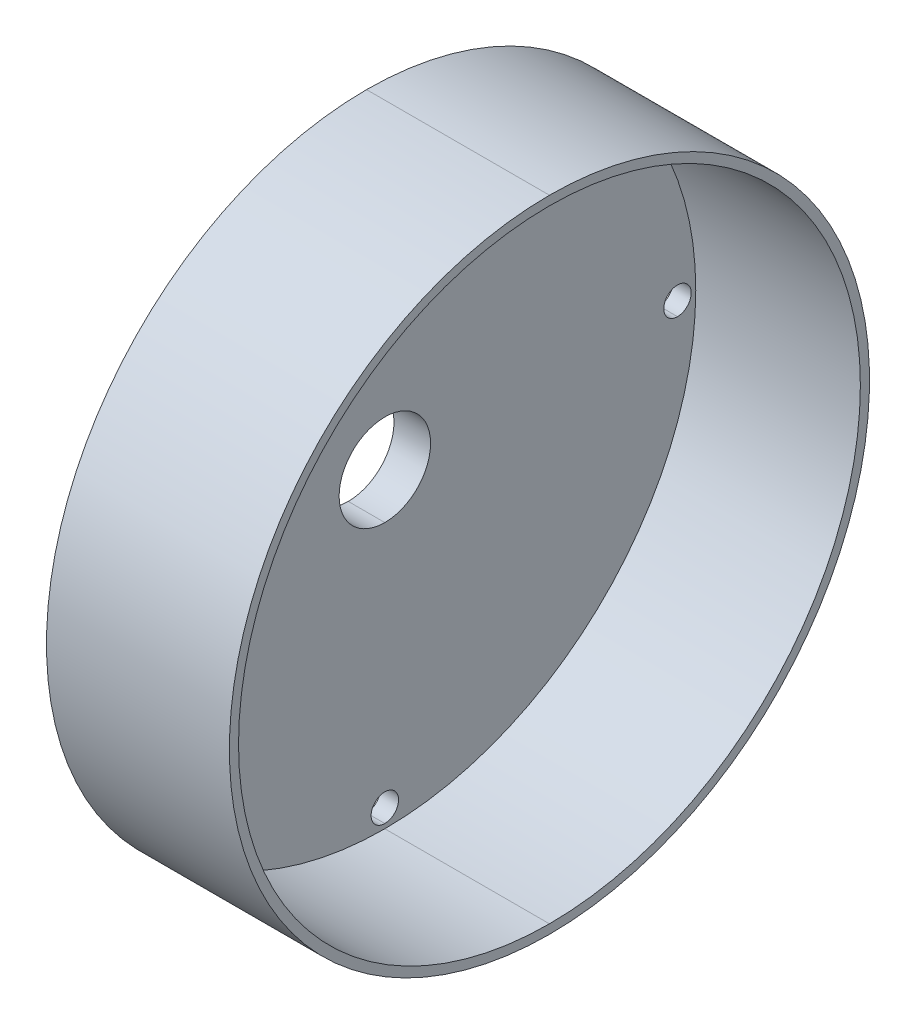
ISO-10303-21;
HEADER;
FILE_DESCRIPTION(('STEP AP214'),'2;1');
FILE_NAME('part.step','',(''),(''),'','','');
FILE_SCHEMA(('AUTOMOTIVE_DESIGN { 1 0 10303 214 1 1 1 1 }'));
ENDSEC;
DATA;
#1=APPLICATION_CONTEXT('core data for automotive mechanical design processes');
#2=APPLICATION_PROTOCOL_DEFINITION('international standard','automotive_design',2000,#1);
#3=PRODUCT_CONTEXT('',#1,'mechanical');
#4=PRODUCT('Part','Part','',(#3));
#5=PRODUCT_RELATED_PRODUCT_CATEGORY('part','',(#4));
#6=PRODUCT_DEFINITION_FORMATION('','',#4);
#7=PRODUCT_DEFINITION_CONTEXT('part definition',#1,'design');
#8=PRODUCT_DEFINITION('design','',#6,#7);
#9=PRODUCT_DEFINITION_SHAPE('','',#8);
#10=(LENGTH_UNIT() NAMED_UNIT(*) SI_UNIT(.MILLI.,.METRE.));
#11=(NAMED_UNIT(*) PLANE_ANGLE_UNIT() SI_UNIT($,.RADIAN.));
#12=(NAMED_UNIT(*) SI_UNIT($,.STERADIAN.) SOLID_ANGLE_UNIT());
#13=UNCERTAINTY_MEASURE_WITH_UNIT(LENGTH_MEASURE(1.E-05),#10,'distance_accuracy_value','');
#14=(GEOMETRIC_REPRESENTATION_CONTEXT(3) GLOBAL_UNCERTAINTY_ASSIGNED_CONTEXT((#13)) GLOBAL_UNIT_ASSIGNED_CONTEXT((#10,
#11,#12)) REPRESENTATION_CONTEXT('',''));
#15=CARTESIAN_POINT('',(0.,0.,0.));
#16=DIRECTION('',(0.,0.,1.));
#17=DIRECTION('',(1.,0.,0.));
#18=AXIS2_PLACEMENT_3D('',#15,#16,#17);
#19=CARTESIAN_POINT('',(6.90730482377682,0.,0.));
#20=DIRECTION('',(1.,0.,0.));
#21=DIRECTION('',(0.,-1.,0.));
#22=AXIS2_PLACEMENT_3D('',#19,#20,#21);
#23=CYLINDRICAL_SURFACE('',#22,5.76923076849808);
#24=DIRECTION('',(-1.,0.,0.));
#25=VECTOR('',#24,1.);
#26=CARTESIAN_POINT('',(6.90730482377682,-5.76923076849807,0.));
#27=LINE('',#26,#25);
#28=CARTESIAN_POINT('',(7.67653559290989,-5.76923076849807,0.));
#29=VERTEX_POINT('',#28);
#30=CARTESIAN_POINT('',(6.13807405464374,-5.76923076849807,0.));
#31=VERTEX_POINT('',#30);
#32=EDGE_CURVE('E72',#29,#31,#27,.T.);
#33=ORIENTED_EDGE('',*,*,#32,.F.);
#34=CARTESIAN_POINT('',(7.67653559290989,0.,0.));
#35=DIRECTION('',(-1.,0.,0.));
#36=DIRECTION('',(0.,-1.,0.));
#37=AXIS2_PLACEMENT_3D('',#34,#35,#36);
#38=CIRCLE('',#37,5.76923076849808);
#39=CARTESIAN_POINT('',(7.67653559290989,5.76923076849808,0.));
#40=VERTEX_POINT('',#39);
#41=EDGE_CURVE('E11',#29,#40,#38,.T.);
#42=ORIENTED_EDGE('',*,*,#41,.T.);
#43=DIRECTION('',(-1.,0.,0.));
#44=VECTOR('',#43,1.);
#45=CARTESIAN_POINT('',(6.90730482377682,5.76923076849808,0.));
#46=LINE('',#45,#44);
#47=CARTESIAN_POINT('',(6.13807405464374,5.76923076849808,0.));
#48=VERTEX_POINT('',#47);
#49=EDGE_CURVE('E59',#40,#48,#46,.T.);
#50=ORIENTED_EDGE('',*,*,#49,.T.);
#51=CARTESIAN_POINT('',(6.13807405464374,0.,0.));
#52=DIRECTION('',(-1.,0.,0.));
#53=DIRECTION('',(0.,-1.,0.));
#54=AXIS2_PLACEMENT_3D('',#51,#52,#53);
#55=CIRCLE('',#54,5.76923076849808);
#56=EDGE_CURVE('E294',#31,#48,#55,.T.);
#57=ORIENTED_EDGE('',*,*,#56,.F.);
#58=EDGE_LOOP('',(#33,#42,#50,#57));
#59=FACE_BOUND('',#58,.T.);
#60=ADVANCED_FACE('F48',(#59),#23,.T.);
#61=CARTESIAN_POINT('',(6.90730482377682,0.,0.));
#62=DIRECTION('',(1.,0.,0.));
#63=DIRECTION('',(0.,-1.,0.));
#64=AXIS2_PLACEMENT_3D('',#61,#62,#63);
#65=CYLINDRICAL_SURFACE('',#64,5.76923076849808);
#66=ORIENTED_EDGE('',*,*,#49,.F.);
#67=CARTESIAN_POINT('',(7.67653559290989,0.,0.));
#68=DIRECTION('',(-1.,0.,0.));
#69=DIRECTION('',(0.,-1.,0.));
#70=AXIS2_PLACEMENT_3D('',#67,#68,#69);
#71=CIRCLE('',#70,5.76923076849808);
#72=EDGE_CURVE('E280',#40,#29,#71,.T.);
#73=ORIENTED_EDGE('',*,*,#72,.T.);
#74=ORIENTED_EDGE('',*,*,#32,.T.);
#75=CARTESIAN_POINT('',(6.13807405464374,0.,0.));
#76=DIRECTION('',(-1.,0.,0.));
#77=DIRECTION('',(0.,-1.,0.));
#78=AXIS2_PLACEMENT_3D('',#75,#76,#77);
#79=CIRCLE('',#78,5.76923076849808);
#80=EDGE_CURVE('E288',#48,#31,#79,.T.);
#81=ORIENTED_EDGE('',*,*,#80,.F.);
#82=EDGE_LOOP('',(#66,#73,#74,#81));
#83=FACE_BOUND('',#82,.T.);
#84=ADVANCED_FACE('F379',(#83),#65,.T.);
#85=CARTESIAN_POINT('',(6.13807405464374,0.,0.));
#86=DIRECTION('',(-1.,0.,0.));
#87=DIRECTION('',(0.,-1.,0.));
#88=AXIS2_PLACEMENT_3D('',#85,#86,#87);
#89=PLANE('',#88);
#90=ORIENTED_EDGE('',*,*,#56,.T.);
#91=ORIENTED_EDGE('',*,*,#80,.T.);
#92=EDGE_LOOP('',(#90,#91));
#93=FACE_BOUND('',#92,.T.);
#94=CARTESIAN_POINT('',(6.13807405464374,0.,0.));
#95=DIRECTION('',(-1.,0.,0.));
#96=DIRECTION('',(0.,-1.,0.));
#97=AXIS2_PLACEMENT_3D('',#94,#95,#96);
#98=CIRCLE('',#97,3.84615384566538);
#99=CARTESIAN_POINT('',(6.13807405464374,3.84615384566539,0.));
#100=VERTEX_POINT('',#99);
#101=CARTESIAN_POINT('',(6.13807405464374,-3.84615384566538,0.));
#102=VERTEX_POINT('',#101);
#103=EDGE_CURVE('E215',#100,#102,#98,.T.);
#104=ORIENTED_EDGE('',*,*,#103,.F.);
#105=CARTESIAN_POINT('',(6.13807405464374,0.,0.));
#106=DIRECTION('',(-1.,0.,0.));
#107=DIRECTION('',(0.,-1.,0.));
#108=AXIS2_PLACEMENT_3D('',#105,#106,#107);
#109=CIRCLE('',#108,3.84615384566538);
#110=EDGE_CURVE('E216',#102,#100,#109,.T.);
#111=ORIENTED_EDGE('',*,*,#110,.F.);
#112=EDGE_LOOP('',(#104,#111));
#113=FACE_BOUND('',#112,.T.);
#114=ADVANCED_FACE('F374',(#93,#113),#89,.T.);
#115=CARTESIAN_POINT('',(15.3688432842407,0.,0.));
#116=DIRECTION('',(-1.,0.,0.));
#117=DIRECTION('',(0.,1.,0.));
#118=AXIS2_PLACEMENT_3D('',#115,#116,#117);
#119=CYLINDRICAL_SURFACE('',#118,26.9230769196577);
#120=DIRECTION('',(1.,0.,0.));
#121=VECTOR('',#120,1.);
#122=CARTESIAN_POINT('',(15.3688432842407,26.9230769196577,0.));
#123=LINE('',#122,#121);
#124=CARTESIAN_POINT('',(7.67653559290989,26.9230769196577,0.));
#125=VERTEX_POINT('',#124);
#126=CARTESIAN_POINT('',(23.0611509755714,26.9230769196577,0.));
#127=VERTEX_POINT('',#126);
#128=EDGE_CURVE('E175',#125,#127,#123,.T.);
#129=ORIENTED_EDGE('',*,*,#128,.F.);
#130=CARTESIAN_POINT('',(7.67653559290989,0.,0.));
#131=DIRECTION('',(1.,0.,0.));
#132=DIRECTION('',(0.,1.,0.));
#133=AXIS2_PLACEMENT_3D('',#130,#131,#132);
#134=CIRCLE('',#133,26.9230769196577);
#135=CARTESIAN_POINT('',(7.67653559290989,-26.9230769196577,0.));
#136=VERTEX_POINT('',#135);
#137=EDGE_CURVE('E285',#125,#136,#134,.T.);
#138=ORIENTED_EDGE('',*,*,#137,.T.);
#139=DIRECTION('',(1.,0.,0.));
#140=VECTOR('',#139,1.);
#141=CARTESIAN_POINT('',(15.3688432842407,-26.9230769196577,0.));
#142=LINE('',#141,#140);
#143=CARTESIAN_POINT('',(23.0611509755714,-26.9230769196577,0.));
#144=VERTEX_POINT('',#143);
#145=EDGE_CURVE('E178',#136,#144,#142,.T.);
#146=ORIENTED_EDGE('',*,*,#145,.T.);
#147=CARTESIAN_POINT('',(23.0611509755714,0.,0.));
#148=DIRECTION('',(1.,0.,0.));
#149=DIRECTION('',(0.,1.,0.));
#150=AXIS2_PLACEMENT_3D('',#147,#148,#149);
#151=CIRCLE('',#150,26.9230769196577);
#152=EDGE_CURVE('E170',#127,#144,#151,.T.);
#153=ORIENTED_EDGE('',*,*,#152,.F.);
#154=EDGE_LOOP('',(#129,#138,#146,#153));
#155=FACE_BOUND('',#154,.T.);
#156=ADVANCED_FACE('F173',(#155),#119,.T.);
#157=CARTESIAN_POINT('',(15.3688432842407,0.,0.));
#158=DIRECTION('',(-1.,0.,0.));
#159=DIRECTION('',(0.,1.,0.));
#160=AXIS2_PLACEMENT_3D('',#157,#158,#159);
#161=CYLINDRICAL_SURFACE('',#160,26.9230769196577);
#162=ORIENTED_EDGE('',*,*,#145,.F.);
#163=CARTESIAN_POINT('',(7.67653559290989,0.,0.));
#164=DIRECTION('',(1.,0.,0.));
#165=DIRECTION('',(0.,1.,0.));
#166=AXIS2_PLACEMENT_3D('',#163,#164,#165);
#167=CIRCLE('',#166,26.9230769196577);
#168=EDGE_CURVE('E191',#136,#125,#167,.T.);
#169=ORIENTED_EDGE('',*,*,#168,.T.);
#170=ORIENTED_EDGE('',*,*,#128,.T.);
#171=CARTESIAN_POINT('',(23.0611509755714,0.,0.));
#172=DIRECTION('',(1.,0.,0.));
#173=DIRECTION('',(0.,1.,0.));
#174=AXIS2_PLACEMENT_3D('',#171,#172,#173);
#175=CIRCLE('',#174,26.9230769196577);
#176=EDGE_CURVE('E184',#144,#127,#175,.T.);
#177=ORIENTED_EDGE('',*,*,#176,.F.);
#178=EDGE_LOOP('',(#162,#169,#170,#177));
#179=FACE_BOUND('',#178,.T.);
#180=ADVANCED_FACE('F189',(#179),#161,.T.);
#181=CARTESIAN_POINT('',(7.67653559290989,0.,0.));
#182=DIRECTION('',(1.,0.,0.));
#183=DIRECTION('',(0.,1.,0.));
#184=AXIS2_PLACEMENT_3D('',#181,#182,#183);
#185=PLANE('',#184);
#186=ORIENTED_EDGE('',*,*,#168,.F.);
#187=ORIENTED_EDGE('',*,*,#137,.F.);
#188=EDGE_LOOP('',(#186,#187));
#189=FACE_BOUND('',#188,.T.);
#190=ORIENTED_EDGE('',*,*,#72,.F.);
#191=ORIENTED_EDGE('',*,*,#41,.F.);
#192=EDGE_LOOP('',(#190,#191));
#193=FACE_BOUND('',#192,.T.);
#194=CARTESIAN_POINT('',(7.67653559290989,0.,24.6153846122585));
#195=DIRECTION('',(1.,0.,0.));
#196=DIRECTION('',(0.,1.,0.));
#197=AXIS2_PLACEMENT_3D('',#194,#195,#196);
#198=CIRCLE('',#197,1.15384615369962);
#199=CARTESIAN_POINT('',(7.67653559290989,-1.15384615369961,24.6153846122585));
#200=VERTEX_POINT('',#199);
#201=CARTESIAN_POINT('',(7.67653559290989,1.15384615369962,24.6153846122585));
#202=VERTEX_POINT('',#201);
#203=EDGE_CURVE('E193',#200,#202,#198,.T.);
#204=ORIENTED_EDGE('',*,*,#203,.T.);
#205=CARTESIAN_POINT('',(7.67653559290989,0.,24.6153846122585));
#206=DIRECTION('',(1.,0.,0.));
#207=DIRECTION('',(0.,1.,0.));
#208=AXIS2_PLACEMENT_3D('',#205,#206,#207);
#209=CIRCLE('',#208,1.15384615369962);
#210=EDGE_CURVE('E223',#202,#200,#209,.T.);
#211=ORIENTED_EDGE('',*,*,#210,.T.);
#212=EDGE_LOOP('',(#204,#211));
#213=FACE_BOUND('',#212,.T.);
#214=CARTESIAN_POINT('',(7.67653559290989,0.,-24.6153846122585));
#215=DIRECTION('',(1.,0.,0.));
#216=DIRECTION('',(0.,1.,0.));
#217=AXIS2_PLACEMENT_3D('',#214,#215,#216);
#218=CIRCLE('',#217,1.15384615369962);
#219=CARTESIAN_POINT('',(7.67653559290989,-1.15384615369961,-24.6153846122585));
#220=VERTEX_POINT('',#219);
#221=CARTESIAN_POINT('',(7.67653559290989,1.15384615369962,-24.6153846122585));
#222=VERTEX_POINT('',#221);
#223=EDGE_CURVE('E224',#220,#222,#218,.T.);
#224=ORIENTED_EDGE('',*,*,#223,.T.);
#225=CARTESIAN_POINT('',(7.67653559290989,0.,-24.6153846122585));
#226=DIRECTION('',(1.,0.,0.));
#227=DIRECTION('',(0.,1.,0.));
#228=AXIS2_PLACEMENT_3D('',#225,#226,#227);
#229=CIRCLE('',#228,1.15384615369962);
#230=EDGE_CURVE('E228',#222,#220,#229,.T.);
#231=ORIENTED_EDGE('',*,*,#230,.T.);
#232=EDGE_LOOP('',(#224,#231));
#233=FACE_BOUND('',#232,.T.);
#234=CARTESIAN_POINT('',(7.67653559290989,24.6153846122585,0.));
#235=DIRECTION('',(1.,0.,0.));
#236=DIRECTION('',(0.,1.,0.));
#237=AXIS2_PLACEMENT_3D('',#234,#235,#236);
#238=CIRCLE('',#237,1.15384615369962);
#239=CARTESIAN_POINT('',(7.67653559290989,23.4615384585589,0.));
#240=VERTEX_POINT('',#239);
#241=CARTESIAN_POINT('',(7.67653559290989,25.7692307659581,0.));
#242=VERTEX_POINT('',#241);
#243=EDGE_CURVE('E229',#240,#242,#238,.T.);
#244=ORIENTED_EDGE('',*,*,#243,.T.);
#245=CARTESIAN_POINT('',(7.67653559290989,24.6153846122585,0.));
#246=DIRECTION('',(1.,0.,0.));
#247=DIRECTION('',(0.,1.,0.));
#248=AXIS2_PLACEMENT_3D('',#245,#246,#247);
#249=CIRCLE('',#248,1.15384615369962);
#250=EDGE_CURVE('E233',#242,#240,#249,.T.);
#251=ORIENTED_EDGE('',*,*,#250,.T.);
#252=EDGE_LOOP('',(#244,#251));
#253=FACE_BOUND('',#252,.T.);
#254=CARTESIAN_POINT('',(7.67653559290989,-24.6153846122584,0.));
#255=DIRECTION('',(1.,0.,0.));
#256=DIRECTION('',(0.,1.,0.));
#257=AXIS2_PLACEMENT_3D('',#254,#255,#256);
#258=CIRCLE('',#257,1.15384615369962);
#259=CARTESIAN_POINT('',(7.67653559290989,-23.4615384585588,0.));
#260=VERTEX_POINT('',#259);
#261=CARTESIAN_POINT('',(7.67653559290989,-25.7692307659581,0.));
#262=VERTEX_POINT('',#261);
#263=EDGE_CURVE('E234',#260,#262,#258,.T.);
#264=ORIENTED_EDGE('',*,*,#263,.T.);
#265=CARTESIAN_POINT('',(7.67653559290989,-24.6153846122584,0.));
#266=DIRECTION('',(1.,0.,0.));
#267=DIRECTION('',(0.,1.,0.));
#268=AXIS2_PLACEMENT_3D('',#265,#266,#267);
#269=CIRCLE('',#268,1.15384615369962);
#270=EDGE_CURVE('E183',#262,#260,#269,.T.);
#271=ORIENTED_EDGE('',*,*,#270,.T.);
#272=EDGE_LOOP('',(#264,#271));
#273=FACE_BOUND('',#272,.T.);
#274=ADVANCED_FACE('F50',(#189,#193,#213,#233,#253,#273),#185,.F.);
#275=CARTESIAN_POINT('',(23.0611509755714,0.,0.));
#276=DIRECTION('',(1.,0.,0.));
#277=DIRECTION('',(0.,1.,0.));
#278=AXIS2_PLACEMENT_3D('',#275,#276,#277);
#279=PLANE('',#278);
#280=ORIENTED_EDGE('',*,*,#152,.T.);
#281=ORIENTED_EDGE('',*,*,#176,.T.);
#282=EDGE_LOOP('',(#280,#281));
#283=FACE_BOUND('',#282,.T.);
#284=CARTESIAN_POINT('',(23.0611509755714,0.,0.));
#285=DIRECTION('',(1.,0.,0.));
#286=DIRECTION('',(0.,1.,0.));
#287=AXIS2_PLACEMENT_3D('',#284,#285,#286);
#288=CIRCLE('',#287,26.1538461505246);
#289=CARTESIAN_POINT('',(23.0611509755714,26.1538461505246,0.));
#290=VERTEX_POINT('',#289);
#291=CARTESIAN_POINT('',(23.0611509755714,-26.1538461505246,0.));
#292=VERTEX_POINT('',#291);
#293=EDGE_CURVE('E261',#290,#292,#288,.T.);
#294=ORIENTED_EDGE('',*,*,#293,.F.);
#295=CARTESIAN_POINT('',(23.0611509755714,0.,0.));
#296=DIRECTION('',(1.,0.,0.));
#297=DIRECTION('',(0.,1.,0.));
#298=AXIS2_PLACEMENT_3D('',#295,#296,#297);
#299=CIRCLE('',#298,26.1538461505246);
#300=EDGE_CURVE('E262',#292,#290,#299,.T.);
#301=ORIENTED_EDGE('',*,*,#300,.F.);
#302=EDGE_LOOP('',(#294,#301));
#303=FACE_BOUND('',#302,.T.);
#304=ADVANCED_FACE('F196',(#283,#303),#279,.T.);
#305=CARTESIAN_POINT('',(2.29192020897835,0.,24.6153846122585));
#306=DIRECTION('',(-1.,0.,0.));
#307=DIRECTION('',(0.,1.,0.));
#308=AXIS2_PLACEMENT_3D('',#305,#306,#307);
#309=CYLINDRICAL_SURFACE('',#308,1.15384615369962);
#310=ORIENTED_EDGE('',*,*,#210,.F.);
#311=DIRECTION('',(-1.,0.,0.));
#312=VECTOR('',#311,1.);
#313=CARTESIAN_POINT('',(2.29192020897835,1.15384615369962,24.6153846122585));
#314=LINE('',#313,#312);
#315=CARTESIAN_POINT('',(9.21499713117605,1.15384615369962,24.6153846122585));
#316=VERTEX_POINT('',#315);
#317=EDGE_CURVE('E301',#316,#202,#314,.T.);
#318=ORIENTED_EDGE('',*,*,#317,.F.);
#319=CARTESIAN_POINT('',(9.21499713117605,0.,24.6153846122585));
#320=DIRECTION('',(1.,0.,0.));
#321=DIRECTION('',(0.,1.,0.));
#322=AXIS2_PLACEMENT_3D('',#319,#320,#321);
#323=CIRCLE('',#322,1.15384615369962);
#324=CARTESIAN_POINT('',(9.21499713117605,-1.15384615369961,24.6153846122585));
#325=VERTEX_POINT('',#324);
#326=EDGE_CURVE('E199',#316,#325,#323,.T.);
#327=ORIENTED_EDGE('',*,*,#326,.T.);
#328=DIRECTION('',(-1.,0.,0.));
#329=VECTOR('',#328,1.);
#330=CARTESIAN_POINT('',(2.29192020897835,-1.15384615369961,24.6153846122585));
#331=LINE('',#330,#329);
#332=EDGE_CURVE('E205',#325,#200,#331,.T.);
#333=ORIENTED_EDGE('',*,*,#332,.T.);
#334=EDGE_LOOP('',(#310,#318,#327,#333));
#335=FACE_BOUND('',#334,.T.);
#336=ADVANCED_FACE('F510',(#335),#309,.F.);
#337=CARTESIAN_POINT('',(2.29192020897835,0.,24.6153846122585));
#338=DIRECTION('',(-1.,0.,0.));
#339=DIRECTION('',(0.,1.,0.));
#340=AXIS2_PLACEMENT_3D('',#337,#338,#339);
#341=CYLINDRICAL_SURFACE('',#340,1.15384615369962);
#342=ORIENTED_EDGE('',*,*,#203,.F.);
#343=ORIENTED_EDGE('',*,*,#332,.F.);
#344=CARTESIAN_POINT('',(9.21499713117605,0.,24.6153846122585));
#345=DIRECTION('',(1.,0.,0.));
#346=DIRECTION('',(0.,1.,0.));
#347=AXIS2_PLACEMENT_3D('',#344,#345,#346);
#348=CIRCLE('',#347,1.15384615369962);
#349=EDGE_CURVE('E240',#325,#316,#348,.T.);
#350=ORIENTED_EDGE('',*,*,#349,.T.);
#351=ORIENTED_EDGE('',*,*,#317,.T.);
#352=EDGE_LOOP('',(#342,#343,#350,#351));
#353=FACE_BOUND('',#352,.T.);
#354=ADVANCED_FACE('F520',(#353),#341,.F.);
#355=CARTESIAN_POINT('',(2.29192020897835,0.,-24.6153846122585));
#356=DIRECTION('',(-1.,0.,0.));
#357=DIRECTION('',(0.,1.,0.));
#358=AXIS2_PLACEMENT_3D('',#355,#356,#357);
#359=CYLINDRICAL_SURFACE('',#358,1.15384615369962);
#360=ORIENTED_EDGE('',*,*,#230,.F.);
#361=DIRECTION('',(-1.,0.,0.));
#362=VECTOR('',#361,1.);
#363=CARTESIAN_POINT('',(2.29192020897835,1.15384615369962,-24.6153846122585));
#364=LINE('',#363,#362);
#365=CARTESIAN_POINT('',(9.21499713117605,1.15384615369962,-24.6153846122585));
#366=VERTEX_POINT('',#365);
#367=EDGE_CURVE('E263',#366,#222,#364,.T.);
#368=ORIENTED_EDGE('',*,*,#367,.F.);
#369=CARTESIAN_POINT('',(9.21499713117605,0.,-24.6153846122585));
#370=DIRECTION('',(1.,0.,0.));
#371=DIRECTION('',(0.,1.,0.));
#372=AXIS2_PLACEMENT_3D('',#369,#370,#371);
#373=CIRCLE('',#372,1.15384615369962);
#374=CARTESIAN_POINT('',(9.21499713117605,-1.15384615369961,-24.6153846122585));
#375=VERTEX_POINT('',#374);
#376=EDGE_CURVE('E297',#366,#375,#373,.T.);
#377=ORIENTED_EDGE('',*,*,#376,.T.);
#378=DIRECTION('',(-1.,0.,0.));
#379=VECTOR('',#378,1.);
#380=CARTESIAN_POINT('',(2.29192020897835,-1.15384615369961,-24.6153846122585));
#381=LINE('',#380,#379);
#382=EDGE_CURVE('E302',#375,#220,#381,.T.);
#383=ORIENTED_EDGE('',*,*,#382,.T.);
#384=EDGE_LOOP('',(#360,#368,#377,#383));
#385=FACE_BOUND('',#384,.T.);
#386=ADVANCED_FACE('F485',(#385),#359,.F.);
#387=CARTESIAN_POINT('',(2.29192020897835,0.,-24.6153846122585));
#388=DIRECTION('',(-1.,0.,0.));
#389=DIRECTION('',(0.,1.,0.));
#390=AXIS2_PLACEMENT_3D('',#387,#388,#389);
#391=CYLINDRICAL_SURFACE('',#390,1.15384615369962);
#392=ORIENTED_EDGE('',*,*,#223,.F.);
#393=ORIENTED_EDGE('',*,*,#382,.F.);
#394=CARTESIAN_POINT('',(9.21499713117605,0.,-24.6153846122585));
#395=DIRECTION('',(1.,0.,0.));
#396=DIRECTION('',(0.,1.,0.));
#397=AXIS2_PLACEMENT_3D('',#394,#395,#396);
#398=CIRCLE('',#397,1.15384615369962);
#399=EDGE_CURVE('E267',#375,#366,#398,.T.);
#400=ORIENTED_EDGE('',*,*,#399,.T.);
#401=ORIENTED_EDGE('',*,*,#367,.T.);
#402=EDGE_LOOP('',(#392,#393,#400,#401));
#403=FACE_BOUND('',#402,.T.);
#404=ADVANCED_FACE('F401',(#403),#391,.F.);
#405=CARTESIAN_POINT('',(2.29192020897835,24.6153846122585,0.));
#406=DIRECTION('',(-1.,0.,0.));
#407=DIRECTION('',(0.,1.,0.));
#408=AXIS2_PLACEMENT_3D('',#405,#406,#407);
#409=CYLINDRICAL_SURFACE('',#408,1.15384615369962);
#410=ORIENTED_EDGE('',*,*,#250,.F.);
#411=DIRECTION('',(-1.,0.,0.));
#412=VECTOR('',#411,1.);
#413=CARTESIAN_POINT('',(2.29192020897835,25.7692307659581,0.));
#414=LINE('',#413,#412);
#415=CARTESIAN_POINT('',(9.21499713117605,25.7692307659581,0.));
#416=VERTEX_POINT('',#415);
#417=EDGE_CURVE('E247',#416,#242,#414,.T.);
#418=ORIENTED_EDGE('',*,*,#417,.F.);
#419=CARTESIAN_POINT('',(9.21499713117605,24.6153846122585,0.));
#420=DIRECTION('',(1.,0.,0.));
#421=DIRECTION('',(0.,1.,0.));
#422=AXIS2_PLACEMENT_3D('',#419,#420,#421);
#423=CIRCLE('',#422,1.15384615369962);
#424=CARTESIAN_POINT('',(9.21499713117605,23.4615384585589,0.));
#425=VERTEX_POINT('',#424);
#426=EDGE_CURVE('E268',#416,#425,#423,.T.);
#427=ORIENTED_EDGE('',*,*,#426,.T.);
#428=DIRECTION('',(-1.,0.,0.));
#429=VECTOR('',#428,1.);
#430=CARTESIAN_POINT('',(2.29192020897835,23.4615384585589,0.));
#431=LINE('',#430,#429);
#432=EDGE_CURVE('E246',#425,#240,#431,.T.);
#433=ORIENTED_EDGE('',*,*,#432,.T.);
#434=EDGE_LOOP('',(#410,#418,#427,#433));
#435=FACE_BOUND('',#434,.T.);
#436=ADVANCED_FACE('F326',(#435),#409,.F.);
#437=CARTESIAN_POINT('',(2.29192020897835,24.6153846122585,0.));
#438=DIRECTION('',(-1.,0.,0.));
#439=DIRECTION('',(0.,1.,0.));
#440=AXIS2_PLACEMENT_3D('',#437,#438,#439);
#441=CYLINDRICAL_SURFACE('',#440,1.15384615369962);
#442=ORIENTED_EDGE('',*,*,#243,.F.);
#443=ORIENTED_EDGE('',*,*,#432,.F.);
#444=CARTESIAN_POINT('',(9.21499713117605,24.6153846122585,0.));
#445=DIRECTION('',(1.,0.,0.));
#446=DIRECTION('',(0.,1.,0.));
#447=AXIS2_PLACEMENT_3D('',#444,#445,#446);
#448=CIRCLE('',#447,1.15384615369962);
#449=EDGE_CURVE('E242',#425,#416,#448,.T.);
#450=ORIENTED_EDGE('',*,*,#449,.T.);
#451=ORIENTED_EDGE('',*,*,#417,.T.);
#452=EDGE_LOOP('',(#442,#443,#450,#451));
#453=FACE_BOUND('',#452,.T.);
#454=ADVANCED_FACE('F334',(#453),#441,.F.);
#455=CARTESIAN_POINT('',(2.29192020897835,-24.6153846122584,0.));
#456=DIRECTION('',(-1.,0.,0.));
#457=DIRECTION('',(0.,1.,0.));
#458=AXIS2_PLACEMENT_3D('',#455,#456,#457);
#459=CYLINDRICAL_SURFACE('',#458,1.15384615369962);
#460=ORIENTED_EDGE('',*,*,#270,.F.);
#461=DIRECTION('',(-1.,0.,0.));
#462=VECTOR('',#461,1.);
#463=CARTESIAN_POINT('',(2.29192020897835,-25.7692307659581,0.));
#464=LINE('',#463,#462);
#465=CARTESIAN_POINT('',(9.21499713117605,-25.7692307659581,0.));
#466=VERTEX_POINT('',#465);
#467=EDGE_CURVE('E284',#466,#262,#464,.T.);
#468=ORIENTED_EDGE('',*,*,#467,.F.);
#469=CARTESIAN_POINT('',(9.21499713117605,-24.6153846122584,0.));
#470=DIRECTION('',(1.,0.,0.));
#471=DIRECTION('',(0.,1.,0.));
#472=AXIS2_PLACEMENT_3D('',#469,#470,#471);
#473=CIRCLE('',#472,1.15384615369962);
#474=CARTESIAN_POINT('',(9.21499713117605,-23.4615384585588,0.));
#475=VERTEX_POINT('',#474);
#476=EDGE_CURVE('E248',#466,#475,#473,.T.);
#477=ORIENTED_EDGE('',*,*,#476,.T.);
#478=DIRECTION('',(-1.,0.,0.));
#479=VECTOR('',#478,1.);
#480=CARTESIAN_POINT('',(2.29192020897835,-23.4615384585588,0.));
#481=LINE('',#480,#479);
#482=EDGE_CURVE('E252',#475,#260,#481,.T.);
#483=ORIENTED_EDGE('',*,*,#482,.T.);
#484=EDGE_LOOP('',(#460,#468,#477,#483));
#485=FACE_BOUND('',#484,.T.);
#486=ADVANCED_FACE('F413',(#485),#459,.F.);
#487=CARTESIAN_POINT('',(2.29192020897835,-24.6153846122584,0.));
#488=DIRECTION('',(-1.,0.,0.));
#489=DIRECTION('',(0.,1.,0.));
#490=AXIS2_PLACEMENT_3D('',#487,#488,#489);
#491=CYLINDRICAL_SURFACE('',#490,1.15384615369962);
#492=ORIENTED_EDGE('',*,*,#263,.F.);
#493=ORIENTED_EDGE('',*,*,#482,.F.);
#494=CARTESIAN_POINT('',(9.21499713117605,-24.6153846122584,0.));
#495=DIRECTION('',(1.,0.,0.));
#496=DIRECTION('',(0.,1.,0.));
#497=AXIS2_PLACEMENT_3D('',#494,#495,#496);
#498=CIRCLE('',#497,1.15384615369962);
#499=EDGE_CURVE('E256',#475,#466,#498,.T.);
#500=ORIENTED_EDGE('',*,*,#499,.T.);
#501=ORIENTED_EDGE('',*,*,#467,.T.);
#502=EDGE_LOOP('',(#492,#493,#500,#501));
#503=FACE_BOUND('',#502,.T.);
#504=ADVANCED_FACE('F406',(#503),#491,.F.);
#505=CARTESIAN_POINT('',(16.1380740533737,0.,0.));
#506=DIRECTION('',(-1.,0.,0.));
#507=DIRECTION('',(0.,1.,0.));
#508=AXIS2_PLACEMENT_3D('',#505,#506,#507);
#509=CYLINDRICAL_SURFACE('',#508,26.1538461505246);
#510=DIRECTION('',(-1.,0.,0.));
#511=VECTOR('',#510,1.);
#512=CARTESIAN_POINT('',(16.1380740533737,26.1538461505246,0.));
#513=LINE('',#512,#511);
#514=CARTESIAN_POINT('',(9.21499713117605,26.1538461505246,0.));
#515=VERTEX_POINT('',#514);
#516=EDGE_CURVE('E209',#290,#515,#513,.T.);
#517=ORIENTED_EDGE('',*,*,#516,.F.);
#518=ORIENTED_EDGE('',*,*,#293,.T.);
#519=DIRECTION('',(-1.,0.,0.));
#520=VECTOR('',#519,1.);
#521=CARTESIAN_POINT('',(16.1380740533737,-26.1538461505246,0.));
#522=LINE('',#521,#520);
#523=CARTESIAN_POINT('',(9.21499713117605,-26.1538461505246,0.));
#524=VERTEX_POINT('',#523);
#525=EDGE_CURVE('E257',#292,#524,#522,.T.);
#526=ORIENTED_EDGE('',*,*,#525,.T.);
#527=CARTESIAN_POINT('',(9.21499713117605,0.,0.));
#528=DIRECTION('',(1.,0.,0.));
#529=DIRECTION('',(0.,1.,0.));
#530=AXIS2_PLACEMENT_3D('',#527,#528,#529);
#531=CIRCLE('',#530,26.1538461505246);
#532=EDGE_CURVE('E444',#515,#524,#531,.T.);
#533=ORIENTED_EDGE('',*,*,#532,.F.);
#534=EDGE_LOOP('',(#517,#518,#526,#533));
#535=FACE_BOUND('',#534,.T.);
#536=ADVANCED_FACE('F402',(#535),#509,.F.);
#537=CARTESIAN_POINT('',(16.1380740533737,0.,0.));
#538=DIRECTION('',(-1.,0.,0.));
#539=DIRECTION('',(0.,1.,0.));
#540=AXIS2_PLACEMENT_3D('',#537,#538,#539);
#541=CYLINDRICAL_SURFACE('',#540,26.1538461505246);
#542=ORIENTED_EDGE('',*,*,#525,.F.);
#543=ORIENTED_EDGE('',*,*,#300,.T.);
#544=ORIENTED_EDGE('',*,*,#516,.T.);
#545=CARTESIAN_POINT('',(9.21499713117605,0.,0.));
#546=DIRECTION('',(1.,0.,0.));
#547=DIRECTION('',(0.,1.,0.));
#548=AXIS2_PLACEMENT_3D('',#545,#546,#547);
#549=CIRCLE('',#548,26.1538461505246);
#550=EDGE_CURVE('E52',#524,#515,#549,.T.);
#551=ORIENTED_EDGE('',*,*,#550,.F.);
#552=EDGE_LOOP('',(#542,#543,#544,#551));
#553=FACE_BOUND('',#552,.T.);
#554=ADVANCED_FACE('F405',(#553),#541,.F.);
#555=CARTESIAN_POINT('',(9.21499713117605,0.,0.));
#556=DIRECTION('',(1.,0.,0.));
#557=DIRECTION('',(0.,1.,0.));
#558=AXIS2_PLACEMENT_3D('',#555,#556,#557);
#559=PLANE('',#558);
#560=ORIENTED_EDGE('',*,*,#532,.T.);
#561=ORIENTED_EDGE('',*,*,#550,.T.);
#562=EDGE_LOOP('',(#560,#561));
#563=FACE_BOUND('',#562,.T.);
#564=ORIENTED_EDGE('',*,*,#326,.F.);
#565=ORIENTED_EDGE('',*,*,#349,.F.);
#566=EDGE_LOOP('',(#564,#565));
#567=FACE_BOUND('',#566,.T.);
#568=ORIENTED_EDGE('',*,*,#376,.F.);
#569=ORIENTED_EDGE('',*,*,#399,.F.);
#570=EDGE_LOOP('',(#568,#569));
#571=FACE_BOUND('',#570,.T.);
#572=ORIENTED_EDGE('',*,*,#426,.F.);
#573=ORIENTED_EDGE('',*,*,#449,.F.);
#574=EDGE_LOOP('',(#572,#573));
#575=FACE_BOUND('',#574,.T.);
#576=ORIENTED_EDGE('',*,*,#476,.F.);
#577=ORIENTED_EDGE('',*,*,#499,.F.);
#578=EDGE_LOOP('',(#576,#577));
#579=FACE_BOUND('',#578,.T.);
#580=CARTESIAN_POINT('',(9.21499713117605,0.,0.));
#581=DIRECTION('',(1.,0.,0.));
#582=DIRECTION('',(0.,1.,0.));
#583=AXIS2_PLACEMENT_3D('',#580,#581,#582);
#584=CIRCLE('',#583,3.84615384566538);
#585=CARTESIAN_POINT('',(9.21499713117605,3.84615384566539,0.));
#586=VERTEX_POINT('',#585);
#587=CARTESIAN_POINT('',(9.21499713117605,-3.84615384566538,0.));
#588=VERTEX_POINT('',#587);
#589=EDGE_CURVE('E214',#586,#588,#584,.T.);
#590=ORIENTED_EDGE('',*,*,#589,.F.);
#591=CARTESIAN_POINT('',(9.21499713117605,0.,0.));
#592=DIRECTION('',(1.,0.,0.));
#593=DIRECTION('',(0.,1.,0.));
#594=AXIS2_PLACEMENT_3D('',#591,#592,#593);
#595=CIRCLE('',#594,3.84615384566538);
#596=EDGE_CURVE('E305',#588,#586,#595,.T.);
#597=ORIENTED_EDGE('',*,*,#596,.F.);
#598=EDGE_LOOP('',(#590,#597));
#599=FACE_BOUND('',#598,.T.);
#600=ADVANCED_FACE('F329',(#563,#567,#571,#575,#579,#599),#559,.T.);
#601=CARTESIAN_POINT('',(6.90730482377682,0.,0.));
#602=DIRECTION('',(1.,0.,0.));
#603=DIRECTION('',(0.,-1.,0.));
#604=AXIS2_PLACEMENT_3D('',#601,#602,#603);
#605=CYLINDRICAL_SURFACE('',#604,3.84615384566538);
#606=ORIENTED_EDGE('',*,*,#110,.T.);
#607=DIRECTION('',(-1.,0.,0.));
#608=VECTOR('',#607,1.);
#609=CARTESIAN_POINT('',(6.90730482377682,3.84615384566539,0.));
#610=LINE('',#609,#608);
#611=EDGE_CURVE('E309',#586,#100,#610,.T.);
#612=ORIENTED_EDGE('',*,*,#611,.F.);
#613=ORIENTED_EDGE('',*,*,#589,.T.);
#614=DIRECTION('',(-1.,0.,0.));
#615=VECTOR('',#614,1.);
#616=CARTESIAN_POINT('',(6.90730482377682,-3.84615384566538,0.));
#617=LINE('',#616,#615);
#618=EDGE_CURVE('E210',#588,#102,#617,.T.);
#619=ORIENTED_EDGE('',*,*,#618,.T.);
#620=EDGE_LOOP('',(#606,#612,#613,#619));
#621=FACE_BOUND('',#620,.T.);
#622=ADVANCED_FACE('F362',(#621),#605,.F.);
#623=CARTESIAN_POINT('',(6.90730482377682,0.,0.));
#624=DIRECTION('',(1.,0.,0.));
#625=DIRECTION('',(0.,-1.,0.));
#626=AXIS2_PLACEMENT_3D('',#623,#624,#625);
#627=CYLINDRICAL_SURFACE('',#626,3.84615384566538);
#628=ORIENTED_EDGE('',*,*,#103,.T.);
#629=ORIENTED_EDGE('',*,*,#618,.F.);
#630=ORIENTED_EDGE('',*,*,#596,.T.);
#631=ORIENTED_EDGE('',*,*,#611,.T.);
#632=EDGE_LOOP('',(#628,#629,#630,#631));
#633=FACE_BOUND('',#632,.T.);
#634=ADVANCED_FACE('F368',(#633),#627,.F.);
#635=CLOSED_SHELL('',(#60,#84,#114,#156,#180,#274,#304,#336,#354,#386,#404,#436,#454,#486,#504,
#536,#554,#600,#622,#634));
#636=MANIFOLD_SOLID_BREP('B2',#635);
#637=ADVANCED_BREP_SHAPE_REPRESENTATION('',(#18,#636),#14);
#638=SHAPE_DEFINITION_REPRESENTATION(#9,#637);
ENDSEC;
END-ISO-10303-21;
